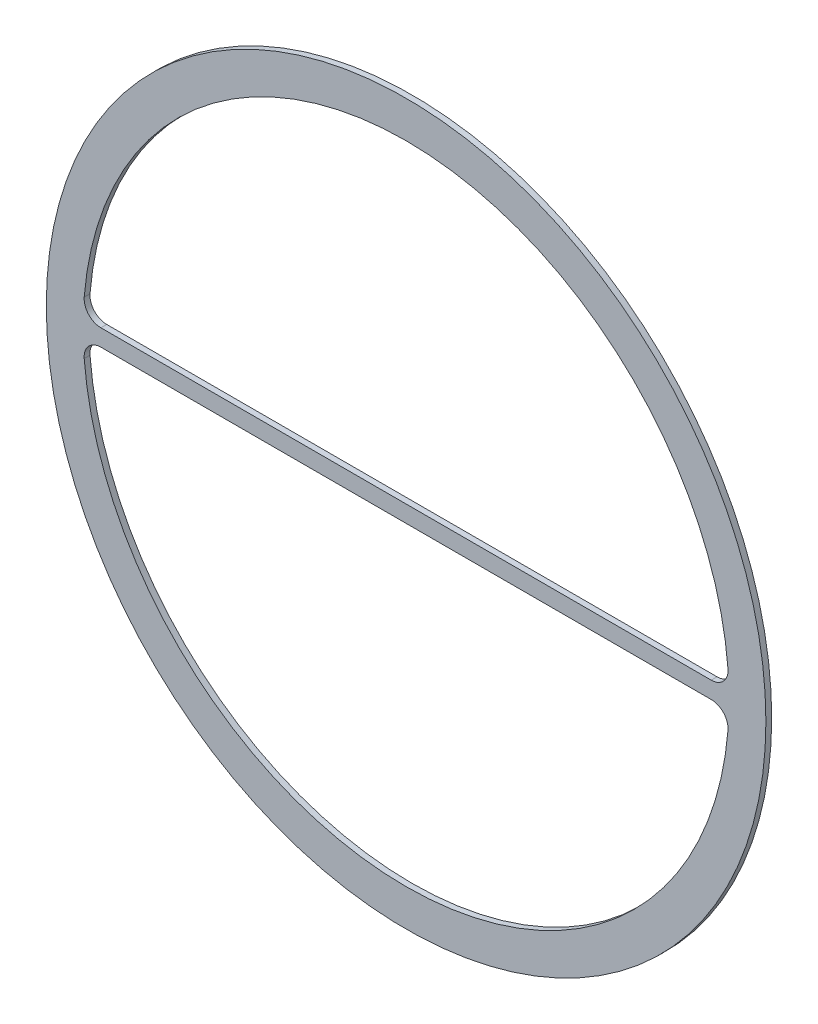
ISO-10303-21;
HEADER;
FILE_DESCRIPTION(('STEP AP214'),'2;1');
FILE_NAME('part.step','',(''),(''),'','','');
FILE_SCHEMA(('AUTOMOTIVE_DESIGN { 1 0 10303 214 1 1 1 1 }'));
ENDSEC;
DATA;
#1=APPLICATION_CONTEXT('core data for automotive mechanical design processes');
#2=APPLICATION_PROTOCOL_DEFINITION('international standard','automotive_design',2000,#1);
#3=PRODUCT_CONTEXT('',#1,'mechanical');
#4=PRODUCT('Part','Part','',(#3));
#5=PRODUCT_RELATED_PRODUCT_CATEGORY('part','',(#4));
#6=PRODUCT_DEFINITION_FORMATION('','',#4);
#7=PRODUCT_DEFINITION_CONTEXT('part definition',#1,'design');
#8=PRODUCT_DEFINITION('design','',#6,#7);
#9=PRODUCT_DEFINITION_SHAPE('','',#8);
#10=(LENGTH_UNIT() NAMED_UNIT(*) SI_UNIT(.MILLI.,.METRE.));
#11=(NAMED_UNIT(*) PLANE_ANGLE_UNIT() SI_UNIT($,.RADIAN.));
#12=(NAMED_UNIT(*) SI_UNIT($,.STERADIAN.) SOLID_ANGLE_UNIT());
#13=UNCERTAINTY_MEASURE_WITH_UNIT(LENGTH_MEASURE(1.E-05),#10,'distance_accuracy_value','');
#14=(GEOMETRIC_REPRESENTATION_CONTEXT(3) GLOBAL_UNCERTAINTY_ASSIGNED_CONTEXT((#13)) GLOBAL_UNIT_ASSIGNED_CONTEXT((#10,
#11,#12)) REPRESENTATION_CONTEXT('',''));
#15=CARTESIAN_POINT('',(0.,0.,0.));
#16=DIRECTION('',(0.,0.,1.));
#17=DIRECTION('',(1.,0.,0.));
#18=AXIS2_PLACEMENT_3D('',#15,#16,#17);
#19=CARTESIAN_POINT('',(0.,0.,2.25));
#20=DIRECTION('',(0.,0.,1.));
#21=DIRECTION('',(1.,0.,0.));
#22=AXIS2_PLACEMENT_3D('',#19,#20,#21);
#23=PLANE('',#22);
#24=CARTESIAN_POINT('',(0.,0.,2.25));
#25=DIRECTION('',(0.,0.,1.));
#26=DIRECTION('',(1.,0.,0.));
#27=AXIS2_PLACEMENT_3D('',#24,#25,#26);
#28=CIRCLE('',#27,278.5);
#29=CARTESIAN_POINT('',(278.5,0.,2.25));
#30=VERTEX_POINT('',#29);
#31=EDGE_CURVE('E121',#30,#30,#28,.T.);
#32=ORIENTED_EDGE('',*,*,#31,.T.);
#33=EDGE_LOOP('',(#32));
#34=FACE_BOUND('',#33,.T.);
#35=DIRECTION('',(1.,0.,0.));
#36=VECTOR('',#35,1.);
#37=CARTESIAN_POINT('',(249.915485714671,6.50000000000003,2.25));
#38=LINE('',#37,#36);
#39=CARTESIAN_POINT('',(-236.196422496193,6.49999999999997,2.25));
#40=VERTEX_POINT('',#39);
#41=CARTESIAN_POINT('',(236.196422496193,6.50000000000003,2.25));
#42=VERTEX_POINT('',#41);
#43=EDGE_CURVE('E167',#40,#42,#38,.T.);
#44=ORIENTED_EDGE('',*,*,#43,.F.);
#45=CARTESIAN_POINT('',(-236.196422496193,19.5,2.25));
#46=DIRECTION('',(0.,0.,1.));
#47=DIRECTION('',(1.,0.,0.));
#48=AXIS2_PLACEMENT_3D('',#45,#46,#47);
#49=CIRCLE('',#48,13.);
#50=CARTESIAN_POINT('',(-249.152344405267,20.5696202531645,2.25));
#51=VERTEX_POINT('',#50);
#52=EDGE_CURVE('E11',#40,#51,#49,.F.);
#53=ORIENTED_EDGE('',*,*,#52,.T.);
#54=CARTESIAN_POINT('',(0.,0.,2.25));
#55=DIRECTION('',(0.,0.,1.));
#56=DIRECTION('',(1.,0.,0.));
#57=AXIS2_PLACEMENT_3D('',#54,#55,#56);
#58=CIRCLE('',#57,250.);
#59=CARTESIAN_POINT('',(249.152344405267,20.5696202531646,2.25));
#60=VERTEX_POINT('',#59);
#61=EDGE_CURVE('E163',#60,#51,#58,.T.);
#62=ORIENTED_EDGE('',*,*,#61,.F.);
#63=CARTESIAN_POINT('',(236.196422496193,19.5,2.25));
#64=DIRECTION('',(0.,0.,1.));
#65=DIRECTION('',(1.,0.,0.));
#66=AXIS2_PLACEMENT_3D('',#63,#64,#65);
#67=CIRCLE('',#66,13.);
#68=EDGE_CURVE('E108',#60,#42,#67,.F.);
#69=ORIENTED_EDGE('',*,*,#68,.T.);
#70=EDGE_LOOP('',(#44,#53,#62,#69));
#71=FACE_BOUND('',#70,.T.);
#72=DIRECTION('',(-1.,0.,0.));
#73=VECTOR('',#72,1.);
#74=CARTESIAN_POINT('',(249.915485714671,-6.49999999999997,2.25));
#75=LINE('',#74,#73);
#76=CARTESIAN_POINT('',(236.196422496193,-6.49999999999997,2.25));
#77=VERTEX_POINT('',#76);
#78=CARTESIAN_POINT('',(-236.196422496193,-6.50000000000003,2.25));
#79=VERTEX_POINT('',#78);
#80=EDGE_CURVE('E172',#77,#79,#75,.T.);
#81=ORIENTED_EDGE('',*,*,#80,.F.);
#82=CARTESIAN_POINT('',(236.196422496193,-19.5,2.25));
#83=DIRECTION('',(0.,0.,1.));
#84=DIRECTION('',(1.,0.,0.));
#85=AXIS2_PLACEMENT_3D('',#82,#83,#84);
#86=CIRCLE('',#85,13.);
#87=CARTESIAN_POINT('',(249.152344405267,-20.5696202531645,2.25));
#88=VERTEX_POINT('',#87);
#89=EDGE_CURVE('E144',#77,#88,#86,.F.);
#90=ORIENTED_EDGE('',*,*,#89,.T.);
#91=CARTESIAN_POINT('',(0.,0.,2.25));
#92=DIRECTION('',(0.,0.,1.));
#93=DIRECTION('',(1.,0.,0.));
#94=AXIS2_PLACEMENT_3D('',#91,#92,#93);
#95=CIRCLE('',#94,250.);
#96=CARTESIAN_POINT('',(-249.152344405267,-20.5696202531646,2.25));
#97=VERTEX_POINT('',#96);
#98=EDGE_CURVE('E174',#97,#88,#95,.T.);
#99=ORIENTED_EDGE('',*,*,#98,.F.);
#100=CARTESIAN_POINT('',(-236.196422496193,-19.5,2.25));
#101=DIRECTION('',(0.,0.,1.));
#102=DIRECTION('',(1.,0.,0.));
#103=AXIS2_PLACEMENT_3D('',#100,#101,#102);
#104=CIRCLE('',#103,13.);
#105=EDGE_CURVE('E107',#97,#79,#104,.F.);
#106=ORIENTED_EDGE('',*,*,#105,.T.);
#107=EDGE_LOOP('',(#81,#90,#99,#106));
#108=FACE_BOUND('',#107,.T.);
#109=ADVANCED_FACE('F32',(#34,#71,#108),#23,.T.);
#110=CARTESIAN_POINT('',(0.,0.,-2.25));
#111=DIRECTION('',(0.,0.,1.));
#112=DIRECTION('',(1.,0.,0.));
#113=AXIS2_PLACEMENT_3D('',#110,#111,#112);
#114=PLANE('',#113);
#115=DIRECTION('',(1.,0.,0.));
#116=VECTOR('',#115,1.);
#117=CARTESIAN_POINT('',(249.915485714671,6.50000000000003,-2.25));
#118=LINE('',#117,#116);
#119=CARTESIAN_POINT('',(-236.196422496193,6.49999999999997,-2.25));
#120=VERTEX_POINT('',#119);
#121=CARTESIAN_POINT('',(236.196422496193,6.50000000000003,-2.25));
#122=VERTEX_POINT('',#121);
#123=EDGE_CURVE('E154',#120,#122,#118,.T.);
#124=ORIENTED_EDGE('',*,*,#123,.T.);
#125=CARTESIAN_POINT('',(236.196422496193,19.5,-2.25));
#126=DIRECTION('',(0.,0.,1.));
#127=DIRECTION('',(1.,0.,0.));
#128=AXIS2_PLACEMENT_3D('',#125,#126,#127);
#129=CIRCLE('',#128,13.);
#130=CARTESIAN_POINT('',(249.152344405267,20.5696202531646,-2.25));
#131=VERTEX_POINT('',#130);
#132=EDGE_CURVE('E146',#122,#131,#129,.T.);
#133=ORIENTED_EDGE('',*,*,#132,.T.);
#134=CARTESIAN_POINT('',(0.,0.,-2.25));
#135=DIRECTION('',(0.,0.,1.));
#136=DIRECTION('',(1.,0.,0.));
#137=AXIS2_PLACEMENT_3D('',#134,#135,#136);
#138=CIRCLE('',#137,250.);
#139=CARTESIAN_POINT('',(-249.152344405267,20.5696202531645,-2.25));
#140=VERTEX_POINT('',#139);
#141=EDGE_CURVE('E155',#131,#140,#138,.T.);
#142=ORIENTED_EDGE('',*,*,#141,.T.);
#143=CARTESIAN_POINT('',(-236.196422496193,19.5,-2.25));
#144=DIRECTION('',(0.,0.,1.));
#145=DIRECTION('',(1.,0.,0.));
#146=AXIS2_PLACEMENT_3D('',#143,#144,#145);
#147=CIRCLE('',#146,13.);
#148=EDGE_CURVE('E40',#140,#120,#147,.T.);
#149=ORIENTED_EDGE('',*,*,#148,.T.);
#150=EDGE_LOOP('',(#124,#133,#142,#149));
#151=FACE_BOUND('',#150,.T.);
#152=CARTESIAN_POINT('',(0.,0.,-2.25));
#153=DIRECTION('',(0.,0.,1.));
#154=DIRECTION('',(1.,0.,0.));
#155=AXIS2_PLACEMENT_3D('',#152,#153,#154);
#156=CIRCLE('',#155,278.5);
#157=CARTESIAN_POINT('',(278.5,0.,-2.25));
#158=VERTEX_POINT('',#157);
#159=EDGE_CURVE('E126',#158,#158,#156,.T.);
#160=ORIENTED_EDGE('',*,*,#159,.F.);
#161=EDGE_LOOP('',(#160));
#162=FACE_BOUND('',#161,.T.);
#163=DIRECTION('',(-1.,0.,0.));
#164=VECTOR('',#163,1.);
#165=CARTESIAN_POINT('',(249.915485714671,-6.49999999999997,-2.25));
#166=LINE('',#165,#164);
#167=CARTESIAN_POINT('',(236.196422496193,-6.49999999999997,-2.25));
#168=VERTEX_POINT('',#167);
#169=CARTESIAN_POINT('',(-236.196422496193,-6.50000000000003,-2.25));
#170=VERTEX_POINT('',#169);
#171=EDGE_CURVE('E102',#168,#170,#166,.T.);
#172=ORIENTED_EDGE('',*,*,#171,.T.);
#173=CARTESIAN_POINT('',(-236.196422496193,-19.5,-2.25));
#174=DIRECTION('',(0.,0.,1.));
#175=DIRECTION('',(1.,0.,0.));
#176=AXIS2_PLACEMENT_3D('',#173,#174,#175);
#177=CIRCLE('',#176,13.);
#178=CARTESIAN_POINT('',(-249.152344405267,-20.5696202531646,-2.25));
#179=VERTEX_POINT('',#178);
#180=EDGE_CURVE('E97',#170,#179,#177,.T.);
#181=ORIENTED_EDGE('',*,*,#180,.T.);
#182=CARTESIAN_POINT('',(0.,0.,-2.25));
#183=DIRECTION('',(0.,0.,1.));
#184=DIRECTION('',(1.,0.,0.));
#185=AXIS2_PLACEMENT_3D('',#182,#183,#184);
#186=CIRCLE('',#185,250.);
#187=CARTESIAN_POINT('',(249.152344405267,-20.5696202531645,-2.25));
#188=VERTEX_POINT('',#187);
#189=EDGE_CURVE('E100',#179,#188,#186,.T.);
#190=ORIENTED_EDGE('',*,*,#189,.T.);
#191=CARTESIAN_POINT('',(236.196422496193,-19.5,-2.25));
#192=DIRECTION('',(0.,0.,1.));
#193=DIRECTION('',(1.,0.,0.));
#194=AXIS2_PLACEMENT_3D('',#191,#192,#193);
#195=CIRCLE('',#194,13.);
#196=EDGE_CURVE('E142',#188,#168,#195,.T.);
#197=ORIENTED_EDGE('',*,*,#196,.T.);
#198=EDGE_LOOP('',(#172,#181,#190,#197));
#199=FACE_BOUND('',#198,.T.);
#200=ADVANCED_FACE('F99',(#151,#162,#199),#114,.F.);
#201=CARTESIAN_POINT('',(0.,0.,2.25));
#202=DIRECTION('',(0.,0.,-1.));
#203=DIRECTION('',(-1.,0.,0.));
#204=AXIS2_PLACEMENT_3D('',#201,#202,#203);
#205=CYLINDRICAL_SURFACE('',#204,278.5);
#206=ORIENTED_EDGE('',*,*,#31,.F.);
#207=EDGE_LOOP('',(#206));
#208=FACE_BOUND('',#207,.T.);
#209=ORIENTED_EDGE('',*,*,#159,.T.);
#210=EDGE_LOOP('',(#209));
#211=FACE_BOUND('',#210,.T.);
#212=ADVANCED_FACE('F191',(#208,#211),#205,.T.);
#213=CARTESIAN_POINT('',(0.,0.,2.25));
#214=DIRECTION('',(0.,0.,-1.));
#215=DIRECTION('',(-1.,0.,0.));
#216=AXIS2_PLACEMENT_3D('',#213,#214,#215);
#217=CYLINDRICAL_SURFACE('',#216,250.);
#218=ORIENTED_EDGE('',*,*,#141,.F.);
#219=DIRECTION('',(0.,0.,-1.));
#220=VECTOR('',#219,1.);
#221=CARTESIAN_POINT('',(249.152344405267,20.5696202531646,2.25));
#222=LINE('',#221,#220);
#223=EDGE_CURVE('E52',#131,#60,#222,.F.);
#224=ORIENTED_EDGE('',*,*,#223,.T.);
#225=ORIENTED_EDGE('',*,*,#61,.T.);
#226=DIRECTION('',(0.,0.,-1.));
#227=VECTOR('',#226,1.);
#228=CARTESIAN_POINT('',(-249.152344405267,20.5696202531645,2.25));
#229=LINE('',#228,#227);
#230=EDGE_CURVE('E138',#51,#140,#229,.T.);
#231=ORIENTED_EDGE('',*,*,#230,.T.);
#232=EDGE_LOOP('',(#218,#224,#225,#231));
#233=FACE_BOUND('',#232,.T.);
#234=ADVANCED_FACE('F165',(#233),#217,.F.);
#235=CARTESIAN_POINT('',(249.915485714671,6.50000000000003,2.25));
#236=DIRECTION('',(0.,1.,0.));
#237=DIRECTION('',(-1.,0.,0.));
#238=AXIS2_PLACEMENT_3D('',#235,#236,#237);
#239=PLANE('',#238);
#240=ORIENTED_EDGE('',*,*,#43,.T.);
#241=DIRECTION('',(0.,0.,1.));
#242=VECTOR('',#241,1.);
#243=CARTESIAN_POINT('',(236.196422496193,6.50000000000003,-2.25));
#244=LINE('',#243,#242);
#245=EDGE_CURVE('E135',#42,#122,#244,.F.);
#246=ORIENTED_EDGE('',*,*,#245,.T.);
#247=ORIENTED_EDGE('',*,*,#123,.F.);
#248=DIRECTION('',(0.,0.,1.));
#249=VECTOR('',#248,1.);
#250=CARTESIAN_POINT('',(-236.196422496193,6.49999999999997,2.25));
#251=LINE('',#250,#249);
#252=EDGE_CURVE('E133',#120,#40,#251,.T.);
#253=ORIENTED_EDGE('',*,*,#252,.T.);
#254=EDGE_LOOP('',(#240,#246,#247,#253));
#255=FACE_BOUND('',#254,.T.);
#256=ADVANCED_FACE('F161',(#255),#239,.T.);
#257=CARTESIAN_POINT('',(0.,0.,2.25));
#258=DIRECTION('',(0.,0.,-1.));
#259=DIRECTION('',(-1.,0.,0.));
#260=AXIS2_PLACEMENT_3D('',#257,#258,#259);
#261=CYLINDRICAL_SURFACE('',#260,250.);
#262=ORIENTED_EDGE('',*,*,#98,.T.);
#263=DIRECTION('',(0.,0.,-1.));
#264=VECTOR('',#263,1.);
#265=CARTESIAN_POINT('',(249.152344405267,-20.5696202531645,2.25));
#266=LINE('',#265,#264);
#267=EDGE_CURVE('E117',#88,#188,#266,.T.);
#268=ORIENTED_EDGE('',*,*,#267,.T.);
#269=ORIENTED_EDGE('',*,*,#189,.F.);
#270=DIRECTION('',(0.,0.,-1.));
#271=VECTOR('',#270,1.);
#272=CARTESIAN_POINT('',(-249.152344405267,-20.5696202531646,2.25));
#273=LINE('',#272,#271);
#274=EDGE_CURVE('E114',#179,#97,#273,.F.);
#275=ORIENTED_EDGE('',*,*,#274,.T.);
#276=EDGE_LOOP('',(#262,#268,#269,#275));
#277=FACE_BOUND('',#276,.T.);
#278=ADVANCED_FACE('F113',(#277),#261,.F.);
#279=CARTESIAN_POINT('',(249.915485714671,-6.49999999999997,2.25));
#280=DIRECTION('',(0.,-1.,0.));
#281=DIRECTION('',(1.,0.,0.));
#282=AXIS2_PLACEMENT_3D('',#279,#280,#281);
#283=PLANE('',#282);
#284=ORIENTED_EDGE('',*,*,#171,.F.);
#285=DIRECTION('',(0.,0.,1.));
#286=VECTOR('',#285,1.);
#287=CARTESIAN_POINT('',(236.196422496193,-6.49999999999997,2.25));
#288=LINE('',#287,#286);
#289=EDGE_CURVE('E131',#168,#77,#288,.T.);
#290=ORIENTED_EDGE('',*,*,#289,.T.);
#291=ORIENTED_EDGE('',*,*,#80,.T.);
#292=DIRECTION('',(0.,0.,1.));
#293=VECTOR('',#292,1.);
#294=CARTESIAN_POINT('',(-236.196422496193,-6.50000000000003,-2.25));
#295=LINE('',#294,#293);
#296=EDGE_CURVE('E123',#79,#170,#295,.F.);
#297=ORIENTED_EDGE('',*,*,#296,.T.);
#298=EDGE_LOOP('',(#284,#290,#291,#297));
#299=FACE_BOUND('',#298,.T.);
#300=ADVANCED_FACE('F184',(#299),#283,.T.);
#301=CARTESIAN_POINT('',(236.196422496193,-19.5,2.25));
#302=DIRECTION('',(0.,0.,-1.));
#303=DIRECTION('',(-1.,0.,0.));
#304=AXIS2_PLACEMENT_3D('',#301,#302,#303);
#305=CYLINDRICAL_SURFACE('',#304,13.);
#306=ORIENTED_EDGE('',*,*,#89,.F.);
#307=ORIENTED_EDGE('',*,*,#289,.F.);
#308=ORIENTED_EDGE('',*,*,#196,.F.);
#309=ORIENTED_EDGE('',*,*,#267,.F.);
#310=EDGE_LOOP('',(#306,#307,#308,#309));
#311=FACE_BOUND('',#310,.T.);
#312=ADVANCED_FACE('F182',(#311),#305,.F.);
#313=CARTESIAN_POINT('',(236.196422496193,19.5,2.25));
#314=DIRECTION('',(0.,0.,-1.));
#315=DIRECTION('',(-1.,0.,0.));
#316=AXIS2_PLACEMENT_3D('',#313,#314,#315);
#317=CYLINDRICAL_SURFACE('',#316,13.);
#318=ORIENTED_EDGE('',*,*,#68,.F.);
#319=ORIENTED_EDGE('',*,*,#223,.F.);
#320=ORIENTED_EDGE('',*,*,#132,.F.);
#321=ORIENTED_EDGE('',*,*,#245,.F.);
#322=EDGE_LOOP('',(#318,#319,#320,#321));
#323=FACE_BOUND('',#322,.T.);
#324=ADVANCED_FACE('F201',(#323),#317,.F.);
#325=CARTESIAN_POINT('',(-236.196422496193,-19.5,2.25));
#326=DIRECTION('',(0.,0.,-1.));
#327=DIRECTION('',(-1.,0.,0.));
#328=AXIS2_PLACEMENT_3D('',#325,#326,#327);
#329=CYLINDRICAL_SURFACE('',#328,13.);
#330=ORIENTED_EDGE('',*,*,#105,.F.);
#331=ORIENTED_EDGE('',*,*,#274,.F.);
#332=ORIENTED_EDGE('',*,*,#180,.F.);
#333=ORIENTED_EDGE('',*,*,#296,.F.);
#334=EDGE_LOOP('',(#330,#331,#332,#333));
#335=FACE_BOUND('',#334,.T.);
#336=ADVANCED_FACE('F120',(#335),#329,.F.);
#337=CARTESIAN_POINT('',(-236.196422496193,19.5,2.25));
#338=DIRECTION('',(0.,0.,-1.));
#339=DIRECTION('',(-1.,0.,0.));
#340=AXIS2_PLACEMENT_3D('',#337,#338,#339);
#341=CYLINDRICAL_SURFACE('',#340,13.);
#342=ORIENTED_EDGE('',*,*,#52,.F.);
#343=ORIENTED_EDGE('',*,*,#252,.F.);
#344=ORIENTED_EDGE('',*,*,#148,.F.);
#345=ORIENTED_EDGE('',*,*,#230,.F.);
#346=EDGE_LOOP('',(#342,#343,#344,#345));
#347=FACE_BOUND('',#346,.T.);
#348=ADVANCED_FACE('F34',(#347),#341,.F.);
#349=CLOSED_SHELL('',(#109,#200,#212,#234,#256,#278,#300,#312,#324,#336,#348));
#350=MANIFOLD_SOLID_BREP('B2',#349);
#351=ADVANCED_BREP_SHAPE_REPRESENTATION('',(#18,#350),#14);
#352=SHAPE_DEFINITION_REPRESENTATION(#9,#351);
ENDSEC;
END-ISO-10303-21;
